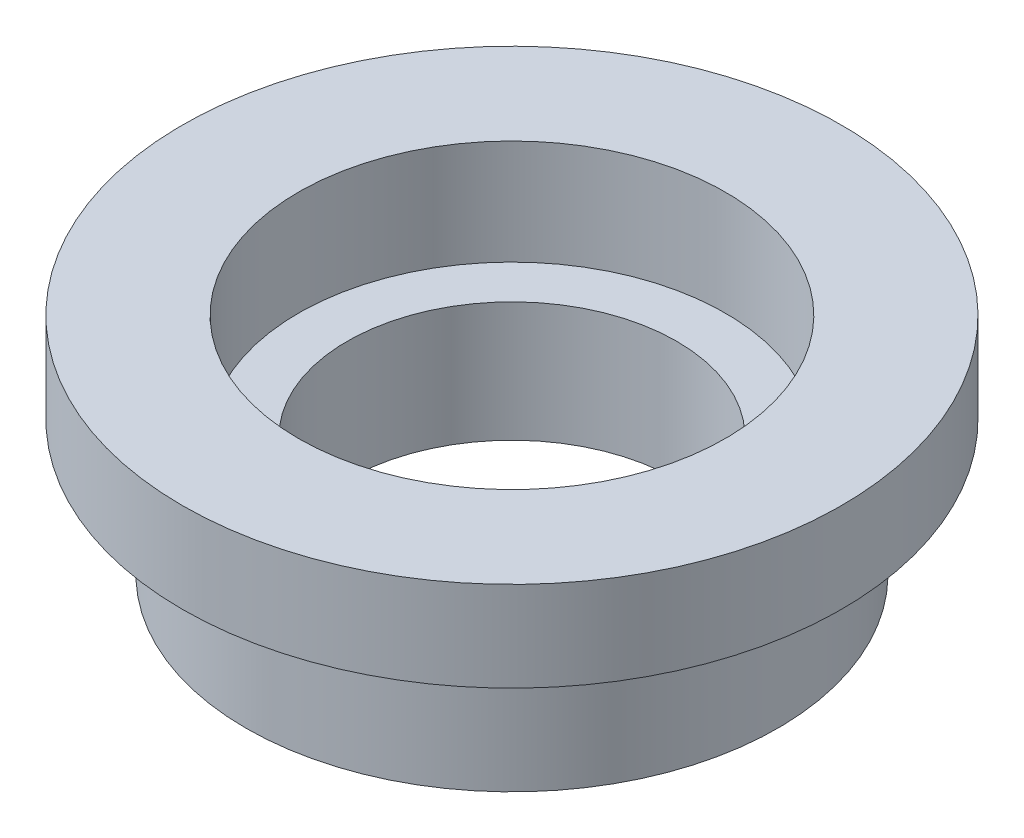
ISO-10303-21;
HEADER;
FILE_DESCRIPTION(('STEP AP214'),'2;1');
FILE_NAME('part.step','',(''),(''),'','','');
FILE_SCHEMA(('AUTOMOTIVE_DESIGN { 1 0 10303 214 1 1 1 1 }'));
ENDSEC;
DATA;
#1=APPLICATION_CONTEXT('core data for automotive mechanical design processes');
#2=APPLICATION_PROTOCOL_DEFINITION('international standard','automotive_design',2000,#1);
#3=PRODUCT_CONTEXT('',#1,'mechanical');
#4=PRODUCT('Part','Part','',(#3));
#5=PRODUCT_RELATED_PRODUCT_CATEGORY('part','',(#4));
#6=PRODUCT_DEFINITION_FORMATION('','',#4);
#7=PRODUCT_DEFINITION_CONTEXT('part definition',#1,'design');
#8=PRODUCT_DEFINITION('design','',#6,#7);
#9=PRODUCT_DEFINITION_SHAPE('','',#8);
#10=(LENGTH_UNIT() NAMED_UNIT(*) SI_UNIT(.MILLI.,.METRE.));
#11=(NAMED_UNIT(*) PLANE_ANGLE_UNIT() SI_UNIT($,.RADIAN.));
#12=(NAMED_UNIT(*) SI_UNIT($,.STERADIAN.) SOLID_ANGLE_UNIT());
#13=UNCERTAINTY_MEASURE_WITH_UNIT(LENGTH_MEASURE(1.E-05),#10,'distance_accuracy_value','');
#14=(GEOMETRIC_REPRESENTATION_CONTEXT(3) GLOBAL_UNCERTAINTY_ASSIGNED_CONTEXT((#13)) GLOBAL_UNIT_ASSIGNED_CONTEXT((#10,
#11,#12)) REPRESENTATION_CONTEXT('',''));
#15=CARTESIAN_POINT('',(0.,0.,0.));
#16=DIRECTION('',(0.,0.,1.));
#17=DIRECTION('',(1.,0.,0.));
#18=AXIS2_PLACEMENT_3D('',#15,#16,#17);
#19=CARTESIAN_POINT('',(0.,5.5,0.));
#20=DIRECTION('',(0.,-1.,0.));
#21=DIRECTION('',(0.,0.,-1.));
#22=AXIS2_PLACEMENT_3D('',#19,#20,#21);
#23=CYLINDRICAL_SURFACE('',#22,9.);
#24=CARTESIAN_POINT('',(0.,2.,0.));
#25=DIRECTION('',(0.,1.,0.));
#26=DIRECTION('',(0.,0.,1.));
#27=AXIS2_PLACEMENT_3D('',#24,#25,#26);
#28=CIRCLE('',#27,9.);
#29=CARTESIAN_POINT('',(0.,2.,9.));
#30=VERTEX_POINT('',#29);
#31=EDGE_CURVE('E54',#30,#30,#28,.T.);
#32=ORIENTED_EDGE('',*,*,#31,.T.);
#33=EDGE_LOOP('',(#32));
#34=FACE_BOUND('',#33,.T.);
#35=CARTESIAN_POINT('',(0.,2.5,0.));
#36=DIRECTION('',(0.,1.,0.));
#37=DIRECTION('',(0.,0.,1.));
#38=AXIS2_PLACEMENT_3D('',#35,#36,#37);
#39=CIRCLE('',#38,9.);
#40=CARTESIAN_POINT('',(0.,2.5,9.));
#41=VERTEX_POINT('',#40);
#42=EDGE_CURVE('E10',#41,#41,#39,.T.);
#43=ORIENTED_EDGE('',*,*,#42,.F.);
#44=EDGE_LOOP('',(#43));
#45=FACE_BOUND('',#44,.T.);
#46=ADVANCED_FACE('F33',(#34,#45),#23,.T.);
#47=CARTESIAN_POINT('',(0.,2.,0.));
#48=DIRECTION('',(0.,1.,0.));
#49=DIRECTION('',(0.,0.,1.));
#50=AXIS2_PLACEMENT_3D('',#47,#48,#49);
#51=PLANE('',#50);
#52=CARTESIAN_POINT('',(0.,2.,0.));
#53=DIRECTION('',(0.,1.,0.));
#54=DIRECTION('',(0.,0.,1.));
#55=AXIS2_PLACEMENT_3D('',#52,#53,#54);
#56=CIRCLE('',#55,5.5);
#57=CARTESIAN_POINT('',(0.,2.,5.5));
#58=VERTEX_POINT('',#57);
#59=EDGE_CURVE('E49',#58,#58,#56,.T.);
#60=ORIENTED_EDGE('',*,*,#59,.F.);
#61=EDGE_LOOP('',(#60));
#62=FACE_BOUND('',#61,.T.);
#63=CARTESIAN_POINT('',(0.,2.,0.));
#64=DIRECTION('',(0.,1.,0.));
#65=DIRECTION('',(0.,0.,1.));
#66=AXIS2_PLACEMENT_3D('',#63,#64,#65);
#67=CIRCLE('',#66,7.125);
#68=CARTESIAN_POINT('',(0.,2.,7.125));
#69=VERTEX_POINT('',#68);
#70=EDGE_CURVE('E60',#69,#69,#67,.T.);
#71=ORIENTED_EDGE('',*,*,#70,.T.);
#72=EDGE_LOOP('',(#71));
#73=FACE_BOUND('',#72,.T.);
#74=ADVANCED_FACE('F84',(#62,#73),#51,.T.);
#75=CARTESIAN_POINT('',(0.,-2.,0.));
#76=DIRECTION('',(0.,1.,0.));
#77=DIRECTION('',(0.,0.,1.));
#78=AXIS2_PLACEMENT_3D('',#75,#76,#77);
#79=PLANE('',#78);
#80=CARTESIAN_POINT('',(0.,-2.,0.));
#81=DIRECTION('',(0.,1.,0.));
#82=DIRECTION('',(0.,0.,1.));
#83=AXIS2_PLACEMENT_3D('',#80,#81,#82);
#84=CIRCLE('',#83,8.875);
#85=CARTESIAN_POINT('',(0.,-2.,8.875));
#86=VERTEX_POINT('',#85);
#87=EDGE_CURVE('E44',#86,#86,#84,.T.);
#88=ORIENTED_EDGE('',*,*,#87,.F.);
#89=EDGE_LOOP('',(#88));
#90=FACE_BOUND('',#89,.T.);
#91=CARTESIAN_POINT('',(0.,-2.,0.));
#92=DIRECTION('',(0.,1.,0.));
#93=DIRECTION('',(0.,0.,1.));
#94=AXIS2_PLACEMENT_3D('',#91,#92,#93);
#95=CIRCLE('',#94,5.5);
#96=CARTESIAN_POINT('',(0.,-2.,5.5));
#97=VERTEX_POINT('',#96);
#98=EDGE_CURVE('E51',#97,#97,#95,.T.);
#99=ORIENTED_EDGE('',*,*,#98,.T.);
#100=EDGE_LOOP('',(#99));
#101=FACE_BOUND('',#100,.T.);
#102=ADVANCED_FACE('F90',(#90,#101),#79,.F.);
#103=CARTESIAN_POINT('',(0.,2.,0.));
#104=DIRECTION('',(0.,-1.,0.));
#105=DIRECTION('',(0.,0.,-1.));
#106=AXIS2_PLACEMENT_3D('',#103,#104,#105);
#107=CYLINDRICAL_SURFACE('',#106,8.875);
#108=CARTESIAN_POINT('',(0.,2.,0.));
#109=DIRECTION('',(0.,1.,0.));
#110=DIRECTION('',(0.,0.,1.));
#111=AXIS2_PLACEMENT_3D('',#108,#109,#110);
#112=CIRCLE('',#111,8.875);
#113=CARTESIAN_POINT('',(0.,2.,8.875));
#114=VERTEX_POINT('',#113);
#115=EDGE_CURVE('E40',#114,#114,#112,.T.);
#116=ORIENTED_EDGE('',*,*,#115,.F.);
#117=EDGE_LOOP('',(#116));
#118=FACE_BOUND('',#117,.T.);
#119=ORIENTED_EDGE('',*,*,#87,.T.);
#120=EDGE_LOOP('',(#119));
#121=FACE_BOUND('',#120,.T.);
#122=ADVANCED_FACE('F35',(#118,#121),#107,.T.);
#123=CARTESIAN_POINT('',(0.,2.,0.));
#124=DIRECTION('',(0.,-1.,0.));
#125=DIRECTION('',(0.,0.,-1.));
#126=AXIS2_PLACEMENT_3D('',#123,#124,#125);
#127=CYLINDRICAL_SURFACE('',#126,5.5);
#128=ORIENTED_EDGE('',*,*,#59,.T.);
#129=EDGE_LOOP('',(#128));
#130=FACE_BOUND('',#129,.T.);
#131=ORIENTED_EDGE('',*,*,#98,.F.);
#132=EDGE_LOOP('',(#131));
#133=FACE_BOUND('',#132,.T.);
#134=ADVANCED_FACE('F98',(#130,#133),#127,.F.);
#135=CARTESIAN_POINT('',(0.,2.,0.));
#136=DIRECTION('',(0.,1.,0.));
#137=DIRECTION('',(0.,0.,1.));
#138=AXIS2_PLACEMENT_3D('',#135,#136,#137);
#139=PLANE('',#138);
#140=ORIENTED_EDGE('',*,*,#31,.F.);
#141=EDGE_LOOP('',(#140));
#142=FACE_BOUND('',#141,.T.);
#143=ORIENTED_EDGE('',*,*,#115,.T.);
#144=EDGE_LOOP('',(#143));
#145=FACE_BOUND('',#144,.T.);
#146=ADVANCED_FACE('F96',(#142,#145),#139,.F.);
#147=CARTESIAN_POINT('',(0.,5.5,0.));
#148=DIRECTION('',(0.,1.,0.));
#149=DIRECTION('',(0.,0.,1.));
#150=AXIS2_PLACEMENT_3D('',#147,#148,#149);
#151=PLANE('',#150);
#152=CARTESIAN_POINT('',(0.,5.5,0.));
#153=DIRECTION('',(0.,1.,0.));
#154=DIRECTION('',(0.,0.,1.));
#155=AXIS2_PLACEMENT_3D('',#152,#153,#154);
#156=CIRCLE('',#155,7.125);
#157=CARTESIAN_POINT('',(0.,5.5,7.125));
#158=VERTEX_POINT('',#157);
#159=EDGE_CURVE('E59',#158,#158,#156,.T.);
#160=ORIENTED_EDGE('',*,*,#159,.F.);
#161=EDGE_LOOP('',(#160));
#162=FACE_BOUND('',#161,.T.);
#163=CARTESIAN_POINT('',(0.,5.5,0.));
#164=DIRECTION('',(0.,1.,0.));
#165=DIRECTION('',(0.,0.,1.));
#166=AXIS2_PLACEMENT_3D('',#163,#164,#165);
#167=CIRCLE('',#166,11.);
#168=CARTESIAN_POINT('',(0.,5.5,11.));
#169=VERTEX_POINT('',#168);
#170=EDGE_CURVE('E66',#169,#169,#167,.T.);
#171=ORIENTED_EDGE('',*,*,#170,.T.);
#172=EDGE_LOOP('',(#171));
#173=FACE_BOUND('',#172,.T.);
#174=ADVANCED_FACE('F125',(#162,#173),#151,.T.);
#175=CARTESIAN_POINT('',(0.,5.5,0.));
#176=DIRECTION('',(0.,-1.,0.));
#177=DIRECTION('',(0.,0.,-1.));
#178=AXIS2_PLACEMENT_3D('',#175,#176,#177);
#179=CYLINDRICAL_SURFACE('',#178,7.125);
#180=ORIENTED_EDGE('',*,*,#159,.T.);
#181=EDGE_LOOP('',(#180));
#182=FACE_BOUND('',#181,.T.);
#183=ORIENTED_EDGE('',*,*,#70,.F.);
#184=EDGE_LOOP('',(#183));
#185=FACE_BOUND('',#184,.T.);
#186=ADVANCED_FACE('F81',(#182,#185),#179,.F.);
#187=CARTESIAN_POINT('',(0.,2.5,0.));
#188=DIRECTION('',(0.,1.,0.));
#189=DIRECTION('',(0.,0.,1.));
#190=AXIS2_PLACEMENT_3D('',#187,#188,#189);
#191=CYLINDRICAL_SURFACE('',#190,11.);
#192=CARTESIAN_POINT('',(0.,2.5,0.));
#193=DIRECTION('',(0.,1.,0.));
#194=DIRECTION('',(0.,0.,1.));
#195=AXIS2_PLACEMENT_3D('',#192,#193,#194);
#196=CIRCLE('',#195,11.);
#197=CARTESIAN_POINT('',(0.,2.5,11.));
#198=VERTEX_POINT('',#197);
#199=EDGE_CURVE('E63',#198,#198,#196,.T.);
#200=ORIENTED_EDGE('',*,*,#199,.T.);
#201=EDGE_LOOP('',(#200));
#202=FACE_BOUND('',#201,.T.);
#203=ORIENTED_EDGE('',*,*,#170,.F.);
#204=EDGE_LOOP('',(#203));
#205=FACE_BOUND('',#204,.T.);
#206=ADVANCED_FACE('F72',(#202,#205),#191,.T.);
#207=CARTESIAN_POINT('',(0.,2.5,0.));
#208=DIRECTION('',(0.,1.,0.));
#209=DIRECTION('',(0.,0.,1.));
#210=AXIS2_PLACEMENT_3D('',#207,#208,#209);
#211=PLANE('',#210);
#212=ORIENTED_EDGE('',*,*,#42,.T.);
#213=EDGE_LOOP('',(#212));
#214=FACE_BOUND('',#213,.T.);
#215=ORIENTED_EDGE('',*,*,#199,.F.);
#216=EDGE_LOOP('',(#215));
#217=FACE_BOUND('',#216,.T.);
#218=ADVANCED_FACE('F75',(#214,#217),#211,.F.);
#219=CLOSED_SHELL('',(#46,#74,#102,#122,#134,#146,#174,#186,#206,#218));
#220=MANIFOLD_SOLID_BREP('B2',#219);
#221=ADVANCED_BREP_SHAPE_REPRESENTATION('',(#18,#220),#14);
#222=SHAPE_DEFINITION_REPRESENTATION(#9,#221);
ENDSEC;
END-ISO-10303-21;
